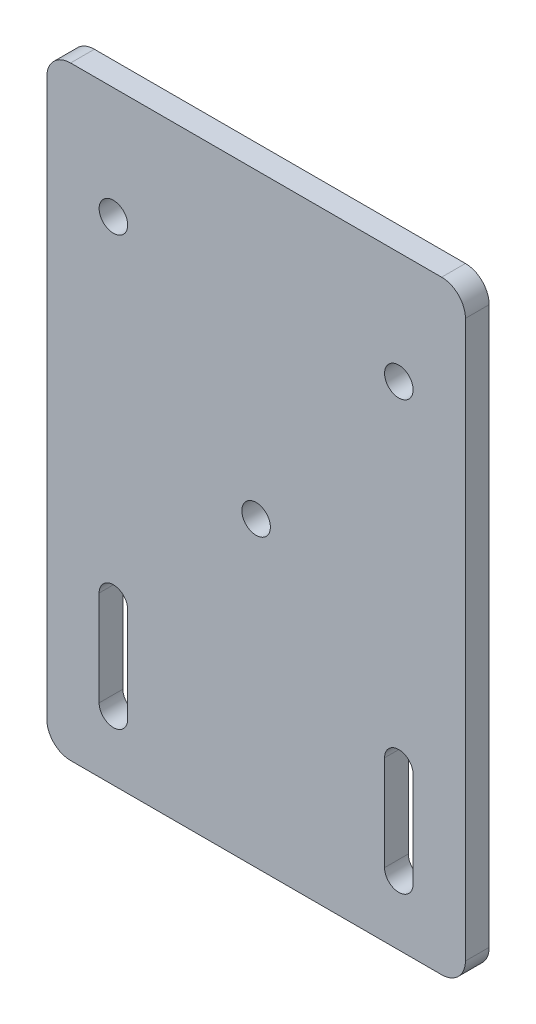
ISO-10303-21;
HEADER;
FILE_DESCRIPTION(('STEP AP214'),'2;1');
FILE_NAME('part.step','',(''),(''),'','','');
FILE_SCHEMA(('AUTOMOTIVE_DESIGN { 1 0 10303 214 1 1 1 1 }'));
ENDSEC;
DATA;
#1=APPLICATION_CONTEXT('core data for automotive mechanical design processes');
#2=APPLICATION_PROTOCOL_DEFINITION('international standard','automotive_design',2000,#1);
#3=PRODUCT_CONTEXT('',#1,'mechanical');
#4=PRODUCT('Part','Part','',(#3));
#5=PRODUCT_RELATED_PRODUCT_CATEGORY('part','',(#4));
#6=PRODUCT_DEFINITION_FORMATION('','',#4);
#7=PRODUCT_DEFINITION_CONTEXT('part definition',#1,'design');
#8=PRODUCT_DEFINITION('design','',#6,#7);
#9=PRODUCT_DEFINITION_SHAPE('','',#8);
#10=(LENGTH_UNIT() NAMED_UNIT(*) SI_UNIT(.MILLI.,.METRE.));
#11=(NAMED_UNIT(*) PLANE_ANGLE_UNIT() SI_UNIT($,.RADIAN.));
#12=(NAMED_UNIT(*) SI_UNIT($,.STERADIAN.) SOLID_ANGLE_UNIT());
#13=UNCERTAINTY_MEASURE_WITH_UNIT(LENGTH_MEASURE(1.E-05),#10,'distance_accuracy_value','');
#14=(GEOMETRIC_REPRESENTATION_CONTEXT(3) GLOBAL_UNCERTAINTY_ASSIGNED_CONTEXT((#13)) GLOBAL_UNIT_ASSIGNED_CONTEXT((#10,
#11,#12)) REPRESENTATION_CONTEXT('',''));
#15=CARTESIAN_POINT('',(0.,0.,0.));
#16=DIRECTION('',(0.,0.,1.));
#17=DIRECTION('',(1.,0.,0.));
#18=AXIS2_PLACEMENT_3D('',#15,#16,#17);
#19=CARTESIAN_POINT('',(39.,58.5,5.));
#20=DIRECTION('',(0.,0.,1.));
#21=DIRECTION('',(1.,0.,0.));
#22=AXIS2_PLACEMENT_3D('',#19,#20,#21);
#23=PLANE('',#22);
#24=CARTESIAN_POINT('',(0.,0.,5.));
#25=DIRECTION('',(0.,0.,1.));
#26=DIRECTION('',(1.,0.,0.));
#27=AXIS2_PLACEMENT_3D('',#24,#25,#26);
#28=CIRCLE('',#27,3.);
#29=CARTESIAN_POINT('',(3.,0.,5.));
#30=VERTEX_POINT('',#29);
#31=EDGE_CURVE('E252',#30,#30,#28,.T.);
#32=ORIENTED_EDGE('',*,*,#31,.F.);
#33=EDGE_LOOP('',(#32));
#34=FACE_BOUND('',#33,.T.);
#35=CARTESIAN_POINT('',(39.,58.5,5.));
#36=DIRECTION('',(0.,0.,1.));
#37=DIRECTION('',(1.,0.,0.));
#38=AXIS2_PLACEMENT_3D('',#35,#36,#37);
#39=CIRCLE('',#38,5.);
#40=CARTESIAN_POINT('',(44.,58.5,5.));
#41=VERTEX_POINT('',#40);
#42=CARTESIAN_POINT('',(39.,63.5,5.));
#43=VERTEX_POINT('',#42);
#44=EDGE_CURVE('E268',#41,#43,#39,.T.);
#45=ORIENTED_EDGE('',*,*,#44,.T.);
#46=DIRECTION('',(-1.,0.,0.));
#47=VECTOR('',#46,1.);
#48=CARTESIAN_POINT('',(-39.,63.5,5.));
#49=LINE('',#48,#47);
#50=CARTESIAN_POINT('',(-39.,63.5,5.));
#51=VERTEX_POINT('',#50);
#52=EDGE_CURVE('E272',#43,#51,#49,.T.);
#53=ORIENTED_EDGE('',*,*,#52,.T.);
#54=CARTESIAN_POINT('',(-39.,58.5,5.));
#55=DIRECTION('',(0.,0.,1.));
#56=DIRECTION('',(-1.,0.,0.));
#57=AXIS2_PLACEMENT_3D('',#54,#55,#56);
#58=CIRCLE('',#57,5.);
#59=CARTESIAN_POINT('',(-44.,58.5,5.));
#60=VERTEX_POINT('',#59);
#61=EDGE_CURVE('E276',#51,#60,#58,.T.);
#62=ORIENTED_EDGE('',*,*,#61,.T.);
#63=DIRECTION('',(0.,-1.,0.));
#64=VECTOR('',#63,1.);
#65=CARTESIAN_POINT('',(-44.,-58.5,5.));
#66=LINE('',#65,#64);
#67=CARTESIAN_POINT('',(-44.,-58.5,5.));
#68=VERTEX_POINT('',#67);
#69=EDGE_CURVE('E279',#60,#68,#66,.T.);
#70=ORIENTED_EDGE('',*,*,#69,.T.);
#71=CARTESIAN_POINT('',(-39.,-58.5,5.));
#72=DIRECTION('',(0.,0.,1.));
#73=DIRECTION('',(-1.,0.,0.));
#74=AXIS2_PLACEMENT_3D('',#71,#72,#73);
#75=CIRCLE('',#74,5.);
#76=CARTESIAN_POINT('',(-39.,-63.5,5.));
#77=VERTEX_POINT('',#76);
#78=EDGE_CURVE('E282',#68,#77,#75,.T.);
#79=ORIENTED_EDGE('',*,*,#78,.T.);
#80=DIRECTION('',(1.,0.,0.));
#81=VECTOR('',#80,1.);
#82=CARTESIAN_POINT('',(-39.,-63.5,5.));
#83=LINE('',#82,#81);
#84=CARTESIAN_POINT('',(39.,-63.5,5.));
#85=VERTEX_POINT('',#84);
#86=EDGE_CURVE('E285',#77,#85,#83,.T.);
#87=ORIENTED_EDGE('',*,*,#86,.T.);
#88=CARTESIAN_POINT('',(39.,-58.5,5.));
#89=DIRECTION('',(0.,0.,1.));
#90=DIRECTION('',(-1.,0.,0.));
#91=AXIS2_PLACEMENT_3D('',#88,#89,#90);
#92=CIRCLE('',#91,5.);
#93=CARTESIAN_POINT('',(44.,-58.5,5.));
#94=VERTEX_POINT('',#93);
#95=EDGE_CURVE('E288',#85,#94,#92,.T.);
#96=ORIENTED_EDGE('',*,*,#95,.T.);
#97=DIRECTION('',(0.,1.,0.));
#98=VECTOR('',#97,1.);
#99=CARTESIAN_POINT('',(44.,-58.5,5.));
#100=LINE('',#99,#98);
#101=EDGE_CURVE('E291',#94,#41,#100,.T.);
#102=ORIENTED_EDGE('',*,*,#101,.T.);
#103=EDGE_LOOP('',(#45,#53,#62,#70,#79,#87,#96,#102));
#104=FACE_BOUND('',#103,.T.);
#105=CARTESIAN_POINT('',(-30.,40.,5.));
#106=DIRECTION('',(0.,0.,1.));
#107=DIRECTION('',(1.,0.,0.));
#108=AXIS2_PLACEMENT_3D('',#105,#106,#107);
#109=CIRCLE('',#108,3.);
#110=CARTESIAN_POINT('',(-27.,40.,5.));
#111=VERTEX_POINT('',#110);
#112=EDGE_CURVE('E260',#111,#111,#109,.T.);
#113=ORIENTED_EDGE('',*,*,#112,.F.);
#114=EDGE_LOOP('',(#113));
#115=FACE_BOUND('',#114,.T.);
#116=CARTESIAN_POINT('',(30.,40.,5.));
#117=DIRECTION('',(0.,0.,1.));
#118=DIRECTION('',(-1.,0.,0.));
#119=AXIS2_PLACEMENT_3D('',#116,#117,#118);
#120=CIRCLE('',#119,3.);
#121=CARTESIAN_POINT('',(27.,40.,5.));
#122=VERTEX_POINT('',#121);
#123=EDGE_CURVE('E244',#122,#122,#120,.T.);
#124=ORIENTED_EDGE('',*,*,#123,.F.);
#125=EDGE_LOOP('',(#124));
#126=FACE_BOUND('',#125,.T.);
#127=DIRECTION('',(0.,1.,0.));
#128=VECTOR('',#127,1.);
#129=CARTESIAN_POINT('',(33.,-30.,5.));
#130=LINE('',#129,#128);
#131=CARTESIAN_POINT('',(33.,-50.,5.));
#132=VERTEX_POINT('',#131);
#133=CARTESIAN_POINT('',(33.,-30.,5.));
#134=VERTEX_POINT('',#133);
#135=EDGE_CURVE('E204',#132,#134,#130,.T.);
#136=ORIENTED_EDGE('',*,*,#135,.F.);
#137=CARTESIAN_POINT('',(30.,-50.,5.));
#138=DIRECTION('',(0.,0.,1.));
#139=DIRECTION('',(-1.,0.,0.));
#140=AXIS2_PLACEMENT_3D('',#137,#138,#139);
#141=CIRCLE('',#140,3.);
#142=CARTESIAN_POINT('',(27.,-50.,5.));
#143=VERTEX_POINT('',#142);
#144=EDGE_CURVE('E201',#143,#132,#141,.T.);
#145=ORIENTED_EDGE('',*,*,#144,.F.);
#146=DIRECTION('',(0.,-1.,0.));
#147=VECTOR('',#146,1.);
#148=CARTESIAN_POINT('',(27.,-30.,5.));
#149=LINE('',#148,#147);
#150=CARTESIAN_POINT('',(27.,-30.,5.));
#151=VERTEX_POINT('',#150);
#152=EDGE_CURVE('E212',#151,#143,#149,.T.);
#153=ORIENTED_EDGE('',*,*,#152,.F.);
#154=CARTESIAN_POINT('',(30.,-30.,5.));
#155=DIRECTION('',(0.,0.,1.));
#156=DIRECTION('',(-1.,0.,0.));
#157=AXIS2_PLACEMENT_3D('',#154,#155,#156);
#158=CIRCLE('',#157,3.);
#159=EDGE_CURVE('E208',#134,#151,#158,.T.);
#160=ORIENTED_EDGE('',*,*,#159,.F.);
#161=EDGE_LOOP('',(#136,#145,#153,#160));
#162=FACE_BOUND('',#161,.T.);
#163=DIRECTION('',(0.,-1.,0.));
#164=VECTOR('',#163,1.);
#165=CARTESIAN_POINT('',(-33.,-30.,5.));
#166=LINE('',#165,#164);
#167=CARTESIAN_POINT('',(-33.,-30.,5.));
#168=VERTEX_POINT('',#167);
#169=CARTESIAN_POINT('',(-33.,-50.,5.));
#170=VERTEX_POINT('',#169);
#171=EDGE_CURVE('E162',#168,#170,#166,.T.);
#172=ORIENTED_EDGE('',*,*,#171,.F.);
#173=CARTESIAN_POINT('',(-30.,-30.,5.));
#174=DIRECTION('',(0.,0.,1.));
#175=DIRECTION('',(1.,0.,0.));
#176=AXIS2_PLACEMENT_3D('',#173,#174,#175);
#177=CIRCLE('',#176,3.);
#178=CARTESIAN_POINT('',(-27.,-30.,5.));
#179=VERTEX_POINT('',#178);
#180=EDGE_CURVE('E153',#179,#168,#177,.T.);
#181=ORIENTED_EDGE('',*,*,#180,.F.);
#182=DIRECTION('',(0.,1.,0.));
#183=VECTOR('',#182,1.);
#184=CARTESIAN_POINT('',(-27.,-30.,5.));
#185=LINE('',#184,#183);
#186=CARTESIAN_POINT('',(-27.,-50.,5.));
#187=VERTEX_POINT('',#186);
#188=EDGE_CURVE('E179',#187,#179,#185,.T.);
#189=ORIENTED_EDGE('',*,*,#188,.F.);
#190=CARTESIAN_POINT('',(-30.,-50.,5.));
#191=DIRECTION('',(0.,0.,1.));
#192=DIRECTION('',(1.,0.,0.));
#193=AXIS2_PLACEMENT_3D('',#190,#191,#192);
#194=CIRCLE('',#193,3.);
#195=EDGE_CURVE('E175',#170,#187,#194,.T.);
#196=ORIENTED_EDGE('',*,*,#195,.F.);
#197=EDGE_LOOP('',(#172,#181,#189,#196));
#198=FACE_BOUND('',#197,.T.);
#199=ADVANCED_FACE('F39',(#34,#104,#115,#126,#162,#198),#23,.T.);
#200=CARTESIAN_POINT('',(39.,58.5,0.));
#201=DIRECTION('',(0.,0.,1.));
#202=DIRECTION('',(1.,0.,0.));
#203=AXIS2_PLACEMENT_3D('',#200,#201,#202);
#204=PLANE('',#203);
#205=CARTESIAN_POINT('',(30.,-50.,0.));
#206=DIRECTION('',(0.,0.,1.));
#207=DIRECTION('',(-1.,0.,0.));
#208=AXIS2_PLACEMENT_3D('',#205,#206,#207);
#209=CIRCLE('',#208,3.);
#210=CARTESIAN_POINT('',(27.,-50.,0.));
#211=VERTEX_POINT('',#210);
#212=CARTESIAN_POINT('',(33.,-50.,0.));
#213=VERTEX_POINT('',#212);
#214=EDGE_CURVE('E171',#211,#213,#209,.T.);
#215=ORIENTED_EDGE('',*,*,#214,.T.);
#216=DIRECTION('',(0.,1.,0.));
#217=VECTOR('',#216,1.);
#218=CARTESIAN_POINT('',(33.,-30.,0.));
#219=LINE('',#218,#217);
#220=CARTESIAN_POINT('',(33.,-30.,0.));
#221=VERTEX_POINT('',#220);
#222=EDGE_CURVE('E219',#213,#221,#219,.T.);
#223=ORIENTED_EDGE('',*,*,#222,.T.);
#224=CARTESIAN_POINT('',(30.,-30.,0.));
#225=DIRECTION('',(0.,0.,1.));
#226=DIRECTION('',(-1.,0.,0.));
#227=AXIS2_PLACEMENT_3D('',#224,#225,#226);
#228=CIRCLE('',#227,3.);
#229=CARTESIAN_POINT('',(27.,-30.,0.));
#230=VERTEX_POINT('',#229);
#231=EDGE_CURVE('E223',#221,#230,#228,.T.);
#232=ORIENTED_EDGE('',*,*,#231,.T.);
#233=DIRECTION('',(0.,-1.,0.));
#234=VECTOR('',#233,1.);
#235=CARTESIAN_POINT('',(27.,-30.,0.));
#236=LINE('',#235,#234);
#237=EDGE_CURVE('E205',#230,#211,#236,.T.);
#238=ORIENTED_EDGE('',*,*,#237,.T.);
#239=EDGE_LOOP('',(#215,#223,#232,#238));
#240=FACE_BOUND('',#239,.T.);
#241=CARTESIAN_POINT('',(39.,58.5,0.));
#242=DIRECTION('',(0.,0.,1.));
#243=DIRECTION('',(1.,0.,0.));
#244=AXIS2_PLACEMENT_3D('',#241,#242,#243);
#245=CIRCLE('',#244,5.);
#246=CARTESIAN_POINT('',(44.,58.5,0.));
#247=VERTEX_POINT('',#246);
#248=CARTESIAN_POINT('',(39.,63.5,0.));
#249=VERTEX_POINT('',#248);
#250=EDGE_CURVE('E264',#247,#249,#245,.T.);
#251=ORIENTED_EDGE('',*,*,#250,.F.);
#252=DIRECTION('',(0.,1.,0.));
#253=VECTOR('',#252,1.);
#254=CARTESIAN_POINT('',(44.,-58.5,0.));
#255=LINE('',#254,#253);
#256=CARTESIAN_POINT('',(44.,-58.5,0.));
#257=VERTEX_POINT('',#256);
#258=EDGE_CURVE('E273',#257,#247,#255,.T.);
#259=ORIENTED_EDGE('',*,*,#258,.F.);
#260=CARTESIAN_POINT('',(39.,-58.5,0.));
#261=DIRECTION('',(0.,0.,1.));
#262=DIRECTION('',(-1.,0.,0.));
#263=AXIS2_PLACEMENT_3D('',#260,#261,#262);
#264=CIRCLE('',#263,5.);
#265=CARTESIAN_POINT('',(39.,-63.5,0.));
#266=VERTEX_POINT('',#265);
#267=EDGE_CURVE('E313',#266,#257,#264,.T.);
#268=ORIENTED_EDGE('',*,*,#267,.F.);
#269=DIRECTION('',(1.,0.,0.));
#270=VECTOR('',#269,1.);
#271=CARTESIAN_POINT('',(-39.,-63.5,0.));
#272=LINE('',#271,#270);
#273=CARTESIAN_POINT('',(-39.,-63.5,0.));
#274=VERTEX_POINT('',#273);
#275=EDGE_CURVE('E310',#274,#266,#272,.T.);
#276=ORIENTED_EDGE('',*,*,#275,.F.);
#277=CARTESIAN_POINT('',(-39.,-58.5,0.));
#278=DIRECTION('',(0.,0.,1.));
#279=DIRECTION('',(-1.,0.,0.));
#280=AXIS2_PLACEMENT_3D('',#277,#278,#279);
#281=CIRCLE('',#280,5.);
#282=CARTESIAN_POINT('',(-44.,-58.5,0.));
#283=VERTEX_POINT('',#282);
#284=EDGE_CURVE('E307',#283,#274,#281,.T.);
#285=ORIENTED_EDGE('',*,*,#284,.F.);
#286=DIRECTION('',(0.,-1.,0.));
#287=VECTOR('',#286,1.);
#288=CARTESIAN_POINT('',(-44.,-58.5,0.));
#289=LINE('',#288,#287);
#290=CARTESIAN_POINT('',(-44.,58.5,0.));
#291=VERTEX_POINT('',#290);
#292=EDGE_CURVE('E304',#291,#283,#289,.T.);
#293=ORIENTED_EDGE('',*,*,#292,.F.);
#294=CARTESIAN_POINT('',(-39.,58.5,0.));
#295=DIRECTION('',(0.,0.,1.));
#296=DIRECTION('',(-1.,0.,0.));
#297=AXIS2_PLACEMENT_3D('',#294,#295,#296);
#298=CIRCLE('',#297,5.);
#299=CARTESIAN_POINT('',(-39.,63.5,0.));
#300=VERTEX_POINT('',#299);
#301=EDGE_CURVE('E301',#300,#291,#298,.T.);
#302=ORIENTED_EDGE('',*,*,#301,.F.);
#303=DIRECTION('',(-1.,0.,0.));
#304=VECTOR('',#303,1.);
#305=CARTESIAN_POINT('',(-39.,63.5,0.));
#306=LINE('',#305,#304);
#307=EDGE_CURVE('E298',#249,#300,#306,.T.);
#308=ORIENTED_EDGE('',*,*,#307,.F.);
#309=EDGE_LOOP('',(#251,#259,#268,#276,#285,#293,#302,#308));
#310=FACE_BOUND('',#309,.T.);
#311=CARTESIAN_POINT('',(-30.,40.,0.));
#312=DIRECTION('',(0.,0.,1.));
#313=DIRECTION('',(1.,0.,0.));
#314=AXIS2_PLACEMENT_3D('',#311,#312,#313);
#315=CIRCLE('',#314,3.);
#316=CARTESIAN_POINT('',(-27.,40.,0.));
#317=VERTEX_POINT('',#316);
#318=EDGE_CURVE('E256',#317,#317,#315,.T.);
#319=ORIENTED_EDGE('',*,*,#318,.T.);
#320=EDGE_LOOP('',(#319));
#321=FACE_BOUND('',#320,.T.);
#322=CARTESIAN_POINT('',(0.,0.,0.));
#323=DIRECTION('',(0.,0.,1.));
#324=DIRECTION('',(1.,0.,0.));
#325=AXIS2_PLACEMENT_3D('',#322,#323,#324);
#326=CIRCLE('',#325,3.);
#327=CARTESIAN_POINT('',(3.,0.,0.));
#328=VERTEX_POINT('',#327);
#329=EDGE_CURVE('E248',#328,#328,#326,.T.);
#330=ORIENTED_EDGE('',*,*,#329,.T.);
#331=EDGE_LOOP('',(#330));
#332=FACE_BOUND('',#331,.T.);
#333=CARTESIAN_POINT('',(30.,40.,0.));
#334=DIRECTION('',(0.,0.,1.));
#335=DIRECTION('',(-1.,0.,0.));
#336=AXIS2_PLACEMENT_3D('',#333,#334,#335);
#337=CIRCLE('',#336,3.);
#338=CARTESIAN_POINT('',(27.,40.,0.));
#339=VERTEX_POINT('',#338);
#340=EDGE_CURVE('E243',#339,#339,#337,.T.);
#341=ORIENTED_EDGE('',*,*,#340,.T.);
#342=EDGE_LOOP('',(#341));
#343=FACE_BOUND('',#342,.T.);
#344=CARTESIAN_POINT('',(-30.,-30.,0.));
#345=DIRECTION('',(0.,0.,1.));
#346=DIRECTION('',(1.,0.,0.));
#347=AXIS2_PLACEMENT_3D('',#344,#345,#346);
#348=CIRCLE('',#347,3.);
#349=CARTESIAN_POINT('',(-27.,-30.,0.));
#350=VERTEX_POINT('',#349);
#351=CARTESIAN_POINT('',(-33.,-30.,0.));
#352=VERTEX_POINT('',#351);
#353=EDGE_CURVE('E63',#350,#352,#348,.T.);
#354=ORIENTED_EDGE('',*,*,#353,.T.);
#355=DIRECTION('',(0.,-1.,0.));
#356=VECTOR('',#355,1.);
#357=CARTESIAN_POINT('',(-33.,-30.,0.));
#358=LINE('',#357,#356);
#359=CARTESIAN_POINT('',(-33.,-50.,0.));
#360=VERTEX_POINT('',#359);
#361=EDGE_CURVE('E169',#352,#360,#358,.T.);
#362=ORIENTED_EDGE('',*,*,#361,.T.);
#363=CARTESIAN_POINT('',(-30.,-50.,0.));
#364=DIRECTION('',(0.,0.,1.));
#365=DIRECTION('',(1.,0.,0.));
#366=AXIS2_PLACEMENT_3D('',#363,#364,#365);
#367=CIRCLE('',#366,3.);
#368=CARTESIAN_POINT('',(-27.,-50.,0.));
#369=VERTEX_POINT('',#368);
#370=EDGE_CURVE('E188',#360,#369,#367,.T.);
#371=ORIENTED_EDGE('',*,*,#370,.T.);
#372=DIRECTION('',(0.,1.,0.));
#373=VECTOR('',#372,1.);
#374=CARTESIAN_POINT('',(-27.,-30.,0.));
#375=LINE('',#374,#373);
#376=EDGE_CURVE('E163',#369,#350,#375,.T.);
#377=ORIENTED_EDGE('',*,*,#376,.T.);
#378=EDGE_LOOP('',(#354,#362,#371,#377));
#379=FACE_BOUND('',#378,.T.);
#380=ADVANCED_FACE('F352',(#240,#310,#321,#332,#343,#379),#204,.F.);
#381=CARTESIAN_POINT('',(39.,58.5,5.));
#382=DIRECTION('',(0.,0.,-1.));
#383=DIRECTION('',(-1.,0.,0.));
#384=AXIS2_PLACEMENT_3D('',#381,#382,#383);
#385=CYLINDRICAL_SURFACE('',#384,5.);
#386=ORIENTED_EDGE('',*,*,#250,.T.);
#387=DIRECTION('',(0.,0.,-1.));
#388=VECTOR('',#387,1.);
#389=CARTESIAN_POINT('',(39.,63.5,5.));
#390=LINE('',#389,#388);
#391=EDGE_CURVE('E11',#43,#249,#390,.T.);
#392=ORIENTED_EDGE('',*,*,#391,.F.);
#393=ORIENTED_EDGE('',*,*,#44,.F.);
#394=DIRECTION('',(0.,0.,-1.));
#395=VECTOR('',#394,1.);
#396=CARTESIAN_POINT('',(44.,58.5,5.));
#397=LINE('',#396,#395);
#398=EDGE_CURVE('E294',#41,#247,#397,.T.);
#399=ORIENTED_EDGE('',*,*,#398,.T.);
#400=EDGE_LOOP('',(#386,#392,#393,#399));
#401=FACE_BOUND('',#400,.T.);
#402=ADVANCED_FACE('F41',(#401),#385,.T.);
#403=CARTESIAN_POINT('',(-39.,63.5,5.));
#404=DIRECTION('',(0.,-1.,0.));
#405=DIRECTION('',(0.,0.,-1.));
#406=AXIS2_PLACEMENT_3D('',#403,#404,#405);
#407=PLANE('',#406);
#408=ORIENTED_EDGE('',*,*,#307,.T.);
#409=DIRECTION('',(0.,0.,-1.));
#410=VECTOR('',#409,1.);
#411=CARTESIAN_POINT('',(-39.,63.5,5.));
#412=LINE('',#411,#410);
#413=EDGE_CURVE('E48',#51,#300,#412,.T.);
#414=ORIENTED_EDGE('',*,*,#413,.F.);
#415=ORIENTED_EDGE('',*,*,#52,.F.);
#416=ORIENTED_EDGE('',*,*,#391,.T.);
#417=EDGE_LOOP('',(#408,#414,#415,#416));
#418=FACE_BOUND('',#417,.T.);
#419=ADVANCED_FACE('F370',(#418),#407,.F.);
#420=CARTESIAN_POINT('',(-39.,58.5,5.));
#421=DIRECTION('',(0.,0.,-1.));
#422=DIRECTION('',(-1.,0.,0.));
#423=AXIS2_PLACEMENT_3D('',#420,#421,#422);
#424=CYLINDRICAL_SURFACE('',#423,5.);
#425=ORIENTED_EDGE('',*,*,#301,.T.);
#426=DIRECTION('',(0.,0.,-1.));
#427=VECTOR('',#426,1.);
#428=CARTESIAN_POINT('',(-44.,58.5,5.));
#429=LINE('',#428,#427);
#430=EDGE_CURVE('E337',#60,#291,#429,.T.);
#431=ORIENTED_EDGE('',*,*,#430,.F.);
#432=ORIENTED_EDGE('',*,*,#61,.F.);
#433=ORIENTED_EDGE('',*,*,#413,.T.);
#434=EDGE_LOOP('',(#425,#431,#432,#433));
#435=FACE_BOUND('',#434,.T.);
#436=ADVANCED_FACE('F346',(#435),#424,.T.);
#437=CARTESIAN_POINT('',(-44.,-58.5,5.));
#438=DIRECTION('',(1.,0.,0.));
#439=DIRECTION('',(0.,0.,-1.));
#440=AXIS2_PLACEMENT_3D('',#437,#438,#439);
#441=PLANE('',#440);
#442=ORIENTED_EDGE('',*,*,#292,.T.);
#443=DIRECTION('',(0.,0.,-1.));
#444=VECTOR('',#443,1.);
#445=CARTESIAN_POINT('',(-44.,-58.5,5.));
#446=LINE('',#445,#444);
#447=EDGE_CURVE('E333',#68,#283,#446,.T.);
#448=ORIENTED_EDGE('',*,*,#447,.F.);
#449=ORIENTED_EDGE('',*,*,#69,.F.);
#450=ORIENTED_EDGE('',*,*,#430,.T.);
#451=EDGE_LOOP('',(#442,#448,#449,#450));
#452=FACE_BOUND('',#451,.T.);
#453=ADVANCED_FACE('F358',(#452),#441,.F.);
#454=CARTESIAN_POINT('',(-39.,-58.5,5.));
#455=DIRECTION('',(0.,0.,-1.));
#456=DIRECTION('',(-1.,0.,0.));
#457=AXIS2_PLACEMENT_3D('',#454,#455,#456);
#458=CYLINDRICAL_SURFACE('',#457,5.);
#459=ORIENTED_EDGE('',*,*,#284,.T.);
#460=DIRECTION('',(0.,0.,-1.));
#461=VECTOR('',#460,1.);
#462=CARTESIAN_POINT('',(-39.,-63.5,5.));
#463=LINE('',#462,#461);
#464=EDGE_CURVE('E329',#77,#274,#463,.T.);
#465=ORIENTED_EDGE('',*,*,#464,.F.);
#466=ORIENTED_EDGE('',*,*,#78,.F.);
#467=ORIENTED_EDGE('',*,*,#447,.T.);
#468=EDGE_LOOP('',(#459,#465,#466,#467));
#469=FACE_BOUND('',#468,.T.);
#470=ADVANCED_FACE('F362',(#469),#458,.T.);
#471=CARTESIAN_POINT('',(-39.,-63.5,5.));
#472=DIRECTION('',(0.,1.,0.));
#473=DIRECTION('',(0.,0.,1.));
#474=AXIS2_PLACEMENT_3D('',#471,#472,#473);
#475=PLANE('',#474);
#476=ORIENTED_EDGE('',*,*,#275,.T.);
#477=DIRECTION('',(0.,0.,-1.));
#478=VECTOR('',#477,1.);
#479=CARTESIAN_POINT('',(39.,-63.5,5.));
#480=LINE('',#479,#478);
#481=EDGE_CURVE('E325',#85,#266,#480,.T.);
#482=ORIENTED_EDGE('',*,*,#481,.F.);
#483=ORIENTED_EDGE('',*,*,#86,.F.);
#484=ORIENTED_EDGE('',*,*,#464,.T.);
#485=EDGE_LOOP('',(#476,#482,#483,#484));
#486=FACE_BOUND('',#485,.T.);
#487=ADVANCED_FACE('F383',(#486),#475,.F.);
#488=CARTESIAN_POINT('',(39.,-58.5,5.));
#489=DIRECTION('',(0.,0.,-1.));
#490=DIRECTION('',(-1.,0.,0.));
#491=AXIS2_PLACEMENT_3D('',#488,#489,#490);
#492=CYLINDRICAL_SURFACE('',#491,5.);
#493=ORIENTED_EDGE('',*,*,#267,.T.);
#494=DIRECTION('',(0.,0.,-1.));
#495=VECTOR('',#494,1.);
#496=CARTESIAN_POINT('',(44.,-58.5,5.));
#497=LINE('',#496,#495);
#498=EDGE_CURVE('E321',#94,#257,#497,.T.);
#499=ORIENTED_EDGE('',*,*,#498,.F.);
#500=ORIENTED_EDGE('',*,*,#95,.F.);
#501=ORIENTED_EDGE('',*,*,#481,.T.);
#502=EDGE_LOOP('',(#493,#499,#500,#501));
#503=FACE_BOUND('',#502,.T.);
#504=ADVANCED_FACE('F381',(#503),#492,.T.);
#505=CARTESIAN_POINT('',(44.,-58.5,5.));
#506=DIRECTION('',(-1.,0.,0.));
#507=DIRECTION('',(0.,0.,1.));
#508=AXIS2_PLACEMENT_3D('',#505,#506,#507);
#509=PLANE('',#508);
#510=ORIENTED_EDGE('',*,*,#258,.T.);
#511=ORIENTED_EDGE('',*,*,#398,.F.);
#512=ORIENTED_EDGE('',*,*,#101,.F.);
#513=ORIENTED_EDGE('',*,*,#498,.T.);
#514=EDGE_LOOP('',(#510,#511,#512,#513));
#515=FACE_BOUND('',#514,.T.);
#516=ADVANCED_FACE('F376',(#515),#509,.F.);
#517=CARTESIAN_POINT('',(-30.,40.,5.));
#518=DIRECTION('',(0.,0.,-1.));
#519=DIRECTION('',(-1.,0.,0.));
#520=AXIS2_PLACEMENT_3D('',#517,#518,#519);
#521=CYLINDRICAL_SURFACE('',#520,3.);
#522=ORIENTED_EDGE('',*,*,#112,.T.);
#523=EDGE_LOOP('',(#522));
#524=FACE_BOUND('',#523,.T.);
#525=ORIENTED_EDGE('',*,*,#318,.F.);
#526=EDGE_LOOP('',(#525));
#527=FACE_BOUND('',#526,.T.);
#528=ADVANCED_FACE('F402',(#524,#527),#521,.F.);
#529=CARTESIAN_POINT('',(0.,0.,5.));
#530=DIRECTION('',(0.,0.,-1.));
#531=DIRECTION('',(-1.,0.,0.));
#532=AXIS2_PLACEMENT_3D('',#529,#530,#531);
#533=CYLINDRICAL_SURFACE('',#532,3.);
#534=ORIENTED_EDGE('',*,*,#31,.T.);
#535=EDGE_LOOP('',(#534));
#536=FACE_BOUND('',#535,.T.);
#537=ORIENTED_EDGE('',*,*,#329,.F.);
#538=EDGE_LOOP('',(#537));
#539=FACE_BOUND('',#538,.T.);
#540=ADVANCED_FACE('F409',(#536,#539),#533,.F.);
#541=CARTESIAN_POINT('',(30.,40.,5.));
#542=DIRECTION('',(0.,0.,-1.));
#543=DIRECTION('',(-1.,0.,0.));
#544=AXIS2_PLACEMENT_3D('',#541,#542,#543);
#545=CYLINDRICAL_SURFACE('',#544,3.);
#546=ORIENTED_EDGE('',*,*,#123,.T.);
#547=EDGE_LOOP('',(#546));
#548=FACE_BOUND('',#547,.T.);
#549=ORIENTED_EDGE('',*,*,#340,.F.);
#550=EDGE_LOOP('',(#549));
#551=FACE_BOUND('',#550,.T.);
#552=ADVANCED_FACE('F414',(#548,#551),#545,.F.);
#553=CARTESIAN_POINT('',(30.,-50.,5.));
#554=DIRECTION('',(0.,0.,-1.));
#555=DIRECTION('',(-1.,0.,0.));
#556=AXIS2_PLACEMENT_3D('',#553,#554,#555);
#557=CYLINDRICAL_SURFACE('',#556,3.);
#558=ORIENTED_EDGE('',*,*,#214,.F.);
#559=DIRECTION('',(0.,0.,-1.));
#560=VECTOR('',#559,1.);
#561=CARTESIAN_POINT('',(27.,-50.,5.));
#562=LINE('',#561,#560);
#563=EDGE_CURVE('E215',#143,#211,#562,.T.);
#564=ORIENTED_EDGE('',*,*,#563,.F.);
#565=ORIENTED_EDGE('',*,*,#144,.T.);
#566=DIRECTION('',(0.,0.,-1.));
#567=VECTOR('',#566,1.);
#568=CARTESIAN_POINT('',(33.,-50.,5.));
#569=LINE('',#568,#567);
#570=EDGE_CURVE('E239',#132,#213,#569,.T.);
#571=ORIENTED_EDGE('',*,*,#570,.T.);
#572=EDGE_LOOP('',(#558,#564,#565,#571));
#573=FACE_BOUND('',#572,.T.);
#574=ADVANCED_FACE('F450',(#573),#557,.F.);
#575=CARTESIAN_POINT('',(33.,-30.,5.));
#576=DIRECTION('',(-1.,0.,0.));
#577=DIRECTION('',(0.,0.,1.));
#578=AXIS2_PLACEMENT_3D('',#575,#576,#577);
#579=PLANE('',#578);
#580=ORIENTED_EDGE('',*,*,#222,.F.);
#581=ORIENTED_EDGE('',*,*,#570,.F.);
#582=ORIENTED_EDGE('',*,*,#135,.T.);
#583=DIRECTION('',(0.,0.,-1.));
#584=VECTOR('',#583,1.);
#585=CARTESIAN_POINT('',(33.,-30.,5.));
#586=LINE('',#585,#584);
#587=EDGE_CURVE('E236',#134,#221,#586,.T.);
#588=ORIENTED_EDGE('',*,*,#587,.T.);
#589=EDGE_LOOP('',(#580,#581,#582,#588));
#590=FACE_BOUND('',#589,.T.);
#591=ADVANCED_FACE('F446',(#590),#579,.T.);
#592=CARTESIAN_POINT('',(30.,-30.,5.));
#593=DIRECTION('',(0.,0.,-1.));
#594=DIRECTION('',(-1.,0.,0.));
#595=AXIS2_PLACEMENT_3D('',#592,#593,#594);
#596=CYLINDRICAL_SURFACE('',#595,3.);
#597=ORIENTED_EDGE('',*,*,#231,.F.);
#598=ORIENTED_EDGE('',*,*,#587,.F.);
#599=ORIENTED_EDGE('',*,*,#159,.T.);
#600=DIRECTION('',(0.,0.,-1.));
#601=VECTOR('',#600,1.);
#602=CARTESIAN_POINT('',(27.,-30.,5.));
#603=LINE('',#602,#601);
#604=EDGE_CURVE('E233',#151,#230,#603,.T.);
#605=ORIENTED_EDGE('',*,*,#604,.T.);
#606=EDGE_LOOP('',(#597,#598,#599,#605));
#607=FACE_BOUND('',#606,.T.);
#608=ADVANCED_FACE('F442',(#607),#596,.F.);
#609=CARTESIAN_POINT('',(27.,-30.,5.));
#610=DIRECTION('',(1.,0.,0.));
#611=DIRECTION('',(0.,0.,-1.));
#612=AXIS2_PLACEMENT_3D('',#609,#610,#611);
#613=PLANE('',#612);
#614=ORIENTED_EDGE('',*,*,#237,.F.);
#615=ORIENTED_EDGE('',*,*,#604,.F.);
#616=ORIENTED_EDGE('',*,*,#152,.T.);
#617=ORIENTED_EDGE('',*,*,#563,.T.);
#618=EDGE_LOOP('',(#614,#615,#616,#617));
#619=FACE_BOUND('',#618,.T.);
#620=ADVANCED_FACE('F439',(#619),#613,.T.);
#621=CARTESIAN_POINT('',(-30.,-30.,5.));
#622=DIRECTION('',(0.,0.,-1.));
#623=DIRECTION('',(-1.,0.,0.));
#624=AXIS2_PLACEMENT_3D('',#621,#622,#623);
#625=CYLINDRICAL_SURFACE('',#624,3.);
#626=ORIENTED_EDGE('',*,*,#353,.F.);
#627=DIRECTION('',(0.,0.,-1.));
#628=VECTOR('',#627,1.);
#629=CARTESIAN_POINT('',(-27.,-30.,5.));
#630=LINE('',#629,#628);
#631=EDGE_CURVE('E157',#179,#350,#630,.T.);
#632=ORIENTED_EDGE('',*,*,#631,.F.);
#633=ORIENTED_EDGE('',*,*,#180,.T.);
#634=DIRECTION('',(0.,0.,-1.));
#635=VECTOR('',#634,1.);
#636=CARTESIAN_POINT('',(-33.,-30.,5.));
#637=LINE('',#636,#635);
#638=EDGE_CURVE('E156',#168,#352,#637,.T.);
#639=ORIENTED_EDGE('',*,*,#638,.T.);
#640=EDGE_LOOP('',(#626,#632,#633,#639));
#641=FACE_BOUND('',#640,.T.);
#642=ADVANCED_FACE('F155',(#641),#625,.F.);
#643=CARTESIAN_POINT('',(-33.,-30.,5.));
#644=DIRECTION('',(1.,0.,0.));
#645=DIRECTION('',(0.,0.,-1.));
#646=AXIS2_PLACEMENT_3D('',#643,#644,#645);
#647=PLANE('',#646);
#648=ORIENTED_EDGE('',*,*,#361,.F.);
#649=ORIENTED_EDGE('',*,*,#638,.F.);
#650=ORIENTED_EDGE('',*,*,#171,.T.);
#651=DIRECTION('',(0.,0.,-1.));
#652=VECTOR('',#651,1.);
#653=CARTESIAN_POINT('',(-33.,-50.,5.));
#654=LINE('',#653,#652);
#655=EDGE_CURVE('E172',#170,#360,#654,.T.);
#656=ORIENTED_EDGE('',*,*,#655,.T.);
#657=EDGE_LOOP('',(#648,#649,#650,#656));
#658=FACE_BOUND('',#657,.T.);
#659=ADVANCED_FACE('F166',(#658),#647,.T.);
#660=CARTESIAN_POINT('',(-30.,-50.,5.));
#661=DIRECTION('',(0.,0.,-1.));
#662=DIRECTION('',(-1.,0.,0.));
#663=AXIS2_PLACEMENT_3D('',#660,#661,#662);
#664=CYLINDRICAL_SURFACE('',#663,3.);
#665=ORIENTED_EDGE('',*,*,#370,.F.);
#666=ORIENTED_EDGE('',*,*,#655,.F.);
#667=ORIENTED_EDGE('',*,*,#195,.T.);
#668=DIRECTION('',(0.,0.,-1.));
#669=VECTOR('',#668,1.);
#670=CARTESIAN_POINT('',(-27.,-50.,5.));
#671=LINE('',#670,#669);
#672=EDGE_CURVE('E55',#187,#369,#671,.T.);
#673=ORIENTED_EDGE('',*,*,#672,.T.);
#674=EDGE_LOOP('',(#665,#666,#667,#673));
#675=FACE_BOUND('',#674,.T.);
#676=ADVANCED_FACE('F427',(#675),#664,.F.);
#677=CARTESIAN_POINT('',(-27.,-30.,5.));
#678=DIRECTION('',(-1.,0.,0.));
#679=DIRECTION('',(0.,0.,1.));
#680=AXIS2_PLACEMENT_3D('',#677,#678,#679);
#681=PLANE('',#680);
#682=ORIENTED_EDGE('',*,*,#376,.F.);
#683=ORIENTED_EDGE('',*,*,#672,.F.);
#684=ORIENTED_EDGE('',*,*,#188,.T.);
#685=ORIENTED_EDGE('',*,*,#631,.T.);
#686=EDGE_LOOP('',(#682,#683,#684,#685));
#687=FACE_BOUND('',#686,.T.);
#688=ADVANCED_FACE('F425',(#687),#681,.T.);
#689=CLOSED_SHELL('',(#199,#380,#402,#419,#436,#453,#470,#487,#504,#516,#528,#540,#552,#574,
#591,#608,#620,#642,#659,#676,#688));
#690=MANIFOLD_SOLID_BREP('B2',#689);
#691=ADVANCED_BREP_SHAPE_REPRESENTATION('',(#18,#690),#14);
#692=SHAPE_DEFINITION_REPRESENTATION(#9,#691);
ENDSEC;
END-ISO-10303-21;
